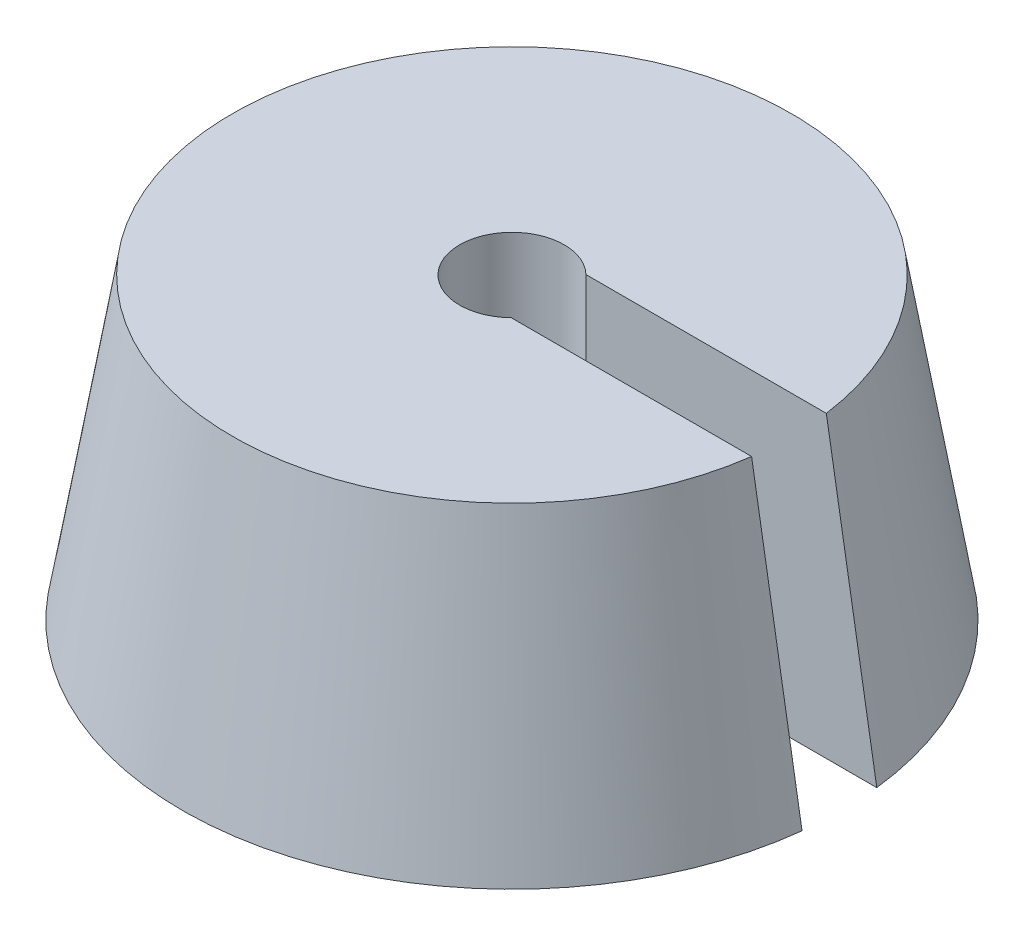
ISO-10303-21;
HEADER;
FILE_DESCRIPTION(('STEP AP214'),'2;1');
FILE_NAME('part.step','',(''),(''),'','','');
FILE_SCHEMA(('AUTOMOTIVE_DESIGN { 1 0 10303 214 1 1 1 1 }'));
ENDSEC;
DATA;
#1=APPLICATION_CONTEXT('core data for automotive mechanical design processes');
#2=APPLICATION_PROTOCOL_DEFINITION('international standard','automotive_design',2000,#1);
#3=PRODUCT_CONTEXT('',#1,'mechanical');
#4=PRODUCT('Part','Part','',(#3));
#5=PRODUCT_RELATED_PRODUCT_CATEGORY('part','',(#4));
#6=PRODUCT_DEFINITION_FORMATION('','',#4);
#7=PRODUCT_DEFINITION_CONTEXT('part definition',#1,'design');
#8=PRODUCT_DEFINITION('design','',#6,#7);
#9=PRODUCT_DEFINITION_SHAPE('','',#8);
#10=(LENGTH_UNIT() NAMED_UNIT(*) SI_UNIT(.MILLI.,.METRE.));
#11=(NAMED_UNIT(*) PLANE_ANGLE_UNIT() SI_UNIT($,.RADIAN.));
#12=(NAMED_UNIT(*) SI_UNIT($,.STERADIAN.) SOLID_ANGLE_UNIT());
#13=UNCERTAINTY_MEASURE_WITH_UNIT(LENGTH_MEASURE(1.E-05),#10,'distance_accuracy_value','');
#14=(GEOMETRIC_REPRESENTATION_CONTEXT(3) GLOBAL_UNCERTAINTY_ASSIGNED_CONTEXT((#13)) GLOBAL_UNIT_ASSIGNED_CONTEXT((#10,
#11,#12)) REPRESENTATION_CONTEXT('',''));
#15=CARTESIAN_POINT('',(0.,0.,0.));
#16=DIRECTION('',(0.,0.,1.));
#17=DIRECTION('',(1.,0.,0.));
#18=AXIS2_PLACEMENT_3D('',#15,#16,#17);
#19=CARTESIAN_POINT('',(0.,20.,0.));
#20=DIRECTION('',(0.,1.,0.));
#21=DIRECTION('',(0.,0.,1.));
#22=AXIS2_PLACEMENT_3D('',#19,#20,#21);
#23=PLANE('',#22);
#24=CARTESIAN_POINT('',(0.,20.,0.));
#25=DIRECTION('',(0.,1.,0.));
#26=DIRECTION('',(0.,0.,1.));
#27=AXIS2_PLACEMENT_3D('',#24,#25,#26);
#28=CIRCLE('',#27,3.5);
#29=CARTESIAN_POINT('',(2.44948974278319,20.,-2.49999999999999));
#30=VERTEX_POINT('',#29);
#31=CARTESIAN_POINT('',(2.44948974278319,20.,2.49999999999999));
#32=VERTEX_POINT('',#31);
#33=EDGE_CURVE('E105',#30,#32,#28,.T.);
#34=ORIENTED_EDGE('',*,*,#33,.F.);
#35=DIRECTION('',(1.,0.,0.));
#36=VECTOR('',#35,1.);
#37=CARTESIAN_POINT('',(0.,20.,-2.49999999999999));
#38=LINE('',#37,#36);
#39=CARTESIAN_POINT('',(18.5321342537766,20.,-2.5));
#40=VERTEX_POINT('',#39);
#41=EDGE_CURVE('E112',#30,#40,#38,.T.);
#42=ORIENTED_EDGE('',*,*,#41,.T.);
#43=CARTESIAN_POINT('',(0.,20.,0.));
#44=DIRECTION('',(0.,1.,0.));
#45=DIRECTION('',(0.,0.,1.));
#46=AXIS2_PLACEMENT_3D('',#43,#44,#45);
#47=CIRCLE('',#46,18.7);
#48=CARTESIAN_POINT('',(18.532135727465,20.,2.50000019879403));
#49=VERTEX_POINT('',#48);
#50=EDGE_CURVE('E49',#40,#49,#47,.T.);
#51=ORIENTED_EDGE('',*,*,#50,.T.);
#52=DIRECTION('',(1.,0.,0.));
#53=VECTOR('',#52,1.);
#54=CARTESIAN_POINT('',(0.,20.,2.49999999999999));
#55=LINE('',#54,#53);
#56=EDGE_CURVE('E64',#32,#49,#55,.T.);
#57=ORIENTED_EDGE('',*,*,#56,.F.);
#58=EDGE_LOOP('',(#34,#42,#51,#57));
#59=FACE_BOUND('',#58,.T.);
#60=ADVANCED_FACE('F45',(#59),#23,.T.);
#61=CARTESIAN_POINT('',(0.,0.,0.));
#62=DIRECTION('',(0.,1.,0.));
#63=DIRECTION('',(0.,0.,1.));
#64=AXIS2_PLACEMENT_3D('',#61,#62,#63);
#65=PLANE('',#64);
#66=DIRECTION('',(1.,0.,0.));
#67=VECTOR('',#66,1.);
#68=CARTESIAN_POINT('',(0.,0.,-2.49999999999999));
#69=LINE('',#68,#67);
#70=CARTESIAN_POINT('',(2.44948974278319,0.,-2.49999999999999));
#71=VERTEX_POINT('',#70);
#72=CARTESIAN_POINT('',(21.9078182391584,0.,-2.5));
#73=VERTEX_POINT('',#72);
#74=EDGE_CURVE('E72',#71,#73,#69,.T.);
#75=ORIENTED_EDGE('',*,*,#74,.F.);
#76=CARTESIAN_POINT('',(0.,0.,0.));
#77=DIRECTION('',(0.,1.,0.));
#78=DIRECTION('',(0.,0.,1.));
#79=AXIS2_PLACEMENT_3D('',#76,#77,#78);
#80=CIRCLE('',#79,3.5);
#81=CARTESIAN_POINT('',(2.44948974278319,0.,2.49999999999999));
#82=VERTEX_POINT('',#81);
#83=EDGE_CURVE('E12',#71,#82,#80,.T.);
#84=ORIENTED_EDGE('',*,*,#83,.T.);
#85=DIRECTION('',(1.,0.,0.));
#86=VECTOR('',#85,1.);
#87=CARTESIAN_POINT('',(0.,0.,2.49999999999999));
#88=LINE('',#87,#86);
#89=CARTESIAN_POINT('',(21.9078182391584,0.,2.49999999999999));
#90=VERTEX_POINT('',#89);
#91=EDGE_CURVE('E90',#82,#90,#88,.T.);
#92=ORIENTED_EDGE('',*,*,#91,.T.);
#93=CARTESIAN_POINT('',(0.,0.,0.));
#94=DIRECTION('',(0.,1.,0.));
#95=DIRECTION('',(0.,0.,1.));
#96=AXIS2_PLACEMENT_3D('',#93,#94,#95);
#97=CIRCLE('',#96,22.05);
#98=EDGE_CURVE('E109',#73,#90,#97,.T.);
#99=ORIENTED_EDGE('',*,*,#98,.F.);
#100=EDGE_LOOP('',(#75,#84,#92,#99));
#101=FACE_BOUND('',#100,.T.);
#102=ADVANCED_FACE('F108',(#101),#65,.F.);
#103=CARTESIAN_POINT('',(0.,20.,0.));
#104=DIRECTION('',(0.,-1.,0.));
#105=DIRECTION('',(0.,0.,-1.));
#106=AXIS2_PLACEMENT_3D('',#103,#104,#105);
#107=CONICAL_SURFACE('',#106,18.7,0.165959378493607);
#108=ORIENTED_EDGE('',*,*,#50,.F.);
#109=CARTESIAN_POINT('',(13.7845060984762,48.0037269776989,-2.5));
#110=CARTESIAN_POINT('',(14.1207851489979,46.0282832970946,-2.5));
#111=CARTESIAN_POINT('',(14.4566948271175,44.0527767862708,-2.5));
#112=CARTESIAN_POINT('',(15.127894766535,40.1016586017115,-2.5));
#113=CARTESIAN_POINT('',(15.4631850278535,38.1260469279795,-2.5));
#114=CARTESIAN_POINT('',(16.468305607829,32.1990853263412,-2.5));
#115=CARTESIAN_POINT('',(17.1373858270297,28.2476082035274,-2.5));
#116=CARTESIAN_POINT('',(18.5428803303303,19.9380905925387,-2.5));
#117=CARTESIAN_POINT('',(19.2791439780787,15.5800246339255,-2.5));
#118=CARTESIAN_POINT('',(20.7504735416152,6.8636904806304,-2.5));
#119=CARTESIAN_POINT('',(21.4855394573795,2.50542228594451,-2.5));
#120=CARTESIAN_POINT('',(22.9547974136016,-6.21126298467467,-2.50000000000001));
#121=CARTESIAN_POINT('',(23.6889894537462,-10.5696800606607,-2.50000000000001));
#122=CARTESIAN_POINT('',(25.1567009519754,-19.2866272222523,-2.50000000000001));
#123=CARTESIAN_POINT('',(25.8902204100962,-23.6451573078518,-2.50000000000001));
#124=CARTESIAN_POINT('',(26.6235043952377,-28.0037269776989,-2.50000000000001));
#125=B_SPLINE_CURVE_WITH_KNOTS('',3,(#109,#110,#111,#112,#113,#114,#115,#116,#117,#118,#119,
#120,#121,#122,#123,#124),.UNSPECIFIED.,.F.,.F.,(4,2,2,2,2,2,2,4),(0.,6.0115847120864,
12.0231692244607,24.0463363793343,37.3058009913597,50.5652658666085,63.8247354914693,
77.0842044022671),.UNSPECIFIED.);
#126=EDGE_CURVE('E56',#40,#73,#125,.T.);
#127=ORIENTED_EDGE('',*,*,#126,.T.);
#128=ORIENTED_EDGE('',*,*,#98,.T.);
#129=CARTESIAN_POINT('',(13.7845060984762,48.0037269776989,2.49999999999999));
#130=CARTESIAN_POINT('',(14.1207851489979,46.0282832970946,2.49999999999999));
#131=CARTESIAN_POINT('',(14.4566948271175,44.0527767862708,2.49999999999999));
#132=CARTESIAN_POINT('',(15.127894766535,40.1016586017115,2.49999999999999));
#133=CARTESIAN_POINT('',(15.4631850278535,38.1260469279795,2.49999999999999));
#134=CARTESIAN_POINT('',(16.468305607829,32.1990853263412,2.49999999999999));
#135=CARTESIAN_POINT('',(17.1373858270297,28.2476082035274,2.49999999999999));
#136=CARTESIAN_POINT('',(18.5428803303303,19.9380905925387,2.49999999999999));
#137=CARTESIAN_POINT('',(19.2791439780787,15.5800246339255,2.49999999999999));
#138=CARTESIAN_POINT('',(20.7504735416152,6.8636904806304,2.49999999999999));
#139=CARTESIAN_POINT('',(21.4855394573795,2.50542228594451,2.49999999999999));
#140=CARTESIAN_POINT('',(22.9547974136016,-6.21126298467467,2.49999999999999));
#141=CARTESIAN_POINT('',(23.6889894537462,-10.5696800606607,2.49999999999999));
#142=CARTESIAN_POINT('',(25.1567009519754,-19.2866272222523,2.49999999999999));
#143=CARTESIAN_POINT('',(25.8902204100962,-23.6451573078518,2.49999999999999));
#144=CARTESIAN_POINT('',(26.6235043952377,-28.0037269776989,2.49999999999999));
#145=B_SPLINE_CURVE_WITH_KNOTS('',3,(#129,#130,#131,#132,#133,#134,#135,#136,#137,#138,#139,
#140,#141,#142,#143,#144),.UNSPECIFIED.,.F.,.F.,(4,2,2,2,2,2,2,4),(0.,6.0115847120864,
12.0231692244607,24.0463363793343,37.3058009913597,50.5652658666085,63.8247354914693,
77.0842044022671),.UNSPECIFIED.);
#146=EDGE_CURVE('E94',#49,#90,#145,.T.);
#147=ORIENTED_EDGE('',*,*,#146,.F.);
#148=EDGE_LOOP('',(#108,#127,#128,#147));
#149=FACE_BOUND('',#148,.T.);
#150=ADVANCED_FACE('F135',(#149),#107,.T.);
#151=CARTESIAN_POINT('',(0.,-9.99999999994061E-05,0.));
#152=DIRECTION('',(0.,1.,0.));
#153=DIRECTION('',(0.,0.,1.));
#154=AXIS2_PLACEMENT_3D('',#151,#152,#153);
#155=CYLINDRICAL_SURFACE('',#154,3.5);
#156=ORIENTED_EDGE('',*,*,#33,.T.);
#157=DIRECTION('',(0.,1.,0.));
#158=VECTOR('',#157,1.);
#159=CARTESIAN_POINT('',(2.44948974278319,-9.99999999994061E-05,2.49999999999999));
#160=LINE('',#159,#158);
#161=EDGE_CURVE('E93',#82,#32,#160,.T.);
#162=ORIENTED_EDGE('',*,*,#161,.F.);
#163=ORIENTED_EDGE('',*,*,#83,.F.);
#164=DIRECTION('',(0.,1.,0.));
#165=VECTOR('',#164,1.);
#166=CARTESIAN_POINT('',(2.44948974278319,-9.99999999994061E-05,-2.49999999999999));
#167=LINE('',#166,#165);
#168=EDGE_CURVE('E99',#71,#30,#167,.T.);
#169=ORIENTED_EDGE('',*,*,#168,.T.);
#170=EDGE_LOOP('',(#156,#162,#163,#169));
#171=FACE_BOUND('',#170,.T.);
#172=ADVANCED_FACE('F102',(#171),#155,.F.);
#173=CARTESIAN_POINT('',(0.,-9.99999999994061E-05,-2.49999999999999));
#174=DIRECTION('',(0.,0.,1.));
#175=DIRECTION('',(1.,0.,0.));
#176=AXIS2_PLACEMENT_3D('',#173,#174,#175);
#177=PLANE('',#176);
#178=ORIENTED_EDGE('',*,*,#168,.F.);
#179=ORIENTED_EDGE('',*,*,#74,.T.);
#180=ORIENTED_EDGE('',*,*,#126,.F.);
#181=ORIENTED_EDGE('',*,*,#41,.F.);
#182=EDGE_LOOP('',(#178,#179,#180,#181));
#183=FACE_BOUND('',#182,.T.);
#184=ADVANCED_FACE('F164',(#183),#177,.T.);
#185=CARTESIAN_POINT('',(0.,-9.99999999994061E-05,2.49999999999999));
#186=DIRECTION('',(0.,0.,1.));
#187=DIRECTION('',(1.,0.,0.));
#188=AXIS2_PLACEMENT_3D('',#185,#186,#187);
#189=PLANE('',#188);
#190=ORIENTED_EDGE('',*,*,#56,.T.);
#191=ORIENTED_EDGE('',*,*,#146,.T.);
#192=ORIENTED_EDGE('',*,*,#91,.F.);
#193=ORIENTED_EDGE('',*,*,#161,.T.);
#194=EDGE_LOOP('',(#190,#191,#192,#193));
#195=FACE_BOUND('',#194,.T.);
#196=ADVANCED_FACE('F92',(#195),#189,.F.);
#197=CLOSED_SHELL('',(#60,#102,#150,#172,#184,#196));
#198=MANIFOLD_SOLID_BREP('B2',#197);
#199=ADVANCED_BREP_SHAPE_REPRESENTATION('',(#18,#198),#14);
#200=SHAPE_DEFINITION_REPRESENTATION(#9,#199);
ENDSEC;
END-ISO-10303-21;
